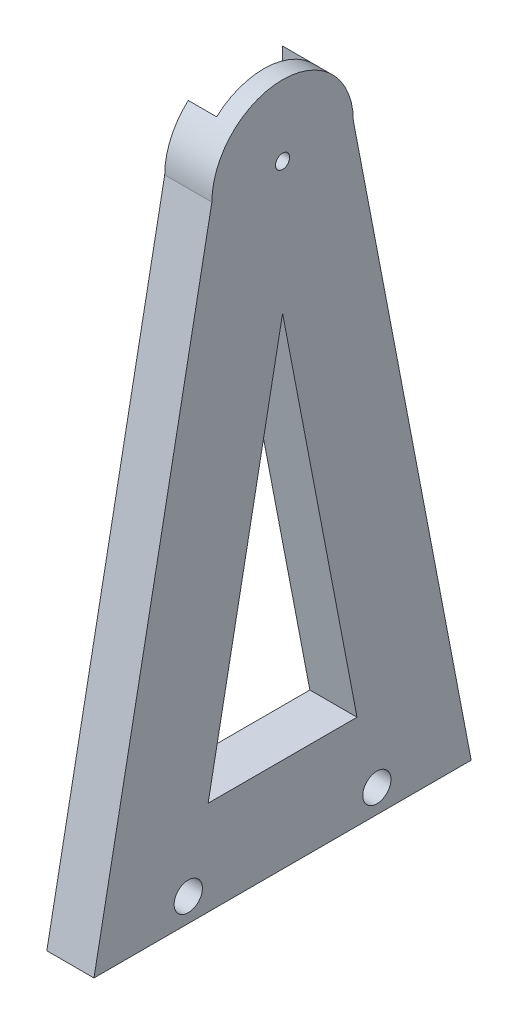
ISO-10303-21;
HEADER;
FILE_DESCRIPTION(('STEP AP214'),'2;1');
FILE_NAME('part.step','',(''),(''),'','','');
FILE_SCHEMA(('AUTOMOTIVE_DESIGN { 1 0 10303 214 1 1 1 1 }'));
ENDSEC;
DATA;
#1=APPLICATION_CONTEXT('core data for automotive mechanical design processes');
#2=APPLICATION_PROTOCOL_DEFINITION('international standard','automotive_design',2000,#1);
#3=PRODUCT_CONTEXT('',#1,'mechanical');
#4=PRODUCT('Part','Part','',(#3));
#5=PRODUCT_RELATED_PRODUCT_CATEGORY('part','',(#4));
#6=PRODUCT_DEFINITION_FORMATION('','',#4);
#7=PRODUCT_DEFINITION_CONTEXT('part definition',#1,'design');
#8=PRODUCT_DEFINITION('design','',#6,#7);
#9=PRODUCT_DEFINITION_SHAPE('','',#8);
#10=(LENGTH_UNIT() NAMED_UNIT(*) SI_UNIT(.MILLI.,.METRE.));
#11=(NAMED_UNIT(*) PLANE_ANGLE_UNIT() SI_UNIT($,.RADIAN.));
#12=(NAMED_UNIT(*) SI_UNIT($,.STERADIAN.) SOLID_ANGLE_UNIT());
#13=UNCERTAINTY_MEASURE_WITH_UNIT(LENGTH_MEASURE(1.E-05),#10,'distance_accuracy_value','');
#14=(GEOMETRIC_REPRESENTATION_CONTEXT(3) GLOBAL_UNCERTAINTY_ASSIGNED_CONTEXT((#13)) GLOBAL_UNIT_ASSIGNED_CONTEXT((#10,
#11,#12)) REPRESENTATION_CONTEXT('',''));
#15=CARTESIAN_POINT('',(0.,0.,0.));
#16=DIRECTION('',(0.,0.,1.));
#17=DIRECTION('',(1.,0.,0.));
#18=AXIS2_PLACEMENT_3D('',#15,#16,#17);
#19=CARTESIAN_POINT('',(10.,4.99999999999999,-20.));
#20=DIRECTION('',(-1.,0.,0.));
#21=DIRECTION('',(0.,0.,1.));
#22=AXIS2_PLACEMENT_3D('',#19,#20,#21);
#23=CYLINDRICAL_SURFACE('',#22,1.65);
#24=CARTESIAN_POINT('',(0.,4.99999999999999,-20.));
#25=DIRECTION('',(-1.,0.,0.));
#26=DIRECTION('',(0.,0.,-1.));
#27=AXIS2_PLACEMENT_3D('',#24,#25,#26);
#28=CIRCLE('',#27,1.65);
#29=CARTESIAN_POINT('',(0.,4.99999999999999,-21.65));
#30=VERTEX_POINT('',#29);
#31=EDGE_CURVE('E166',#30,#30,#28,.T.);
#32=ORIENTED_EDGE('',*,*,#31,.T.);
#33=EDGE_LOOP('',(#32));
#34=FACE_BOUND('',#33,.T.);
#35=CARTESIAN_POINT('',(5.,4.99999999999999,-20.));
#36=DIRECTION('',(1.,0.,0.));
#37=DIRECTION('',(0.,0.,-1.));
#38=AXIS2_PLACEMENT_3D('',#35,#36,#37);
#39=CIRCLE('',#38,1.65);
#40=CARTESIAN_POINT('',(5.,4.99999999999999,-21.65));
#41=VERTEX_POINT('',#40);
#42=EDGE_CURVE('E36',#41,#41,#39,.F.);
#43=ORIENTED_EDGE('',*,*,#42,.F.);
#44=EDGE_LOOP('',(#43));
#45=FACE_BOUND('',#44,.T.);
#46=ADVANCED_FACE('F32',(#34,#45),#23,.F.);
#47=CARTESIAN_POINT('',(10.,4.99999999999999,20.));
#48=DIRECTION('',(-1.,0.,0.));
#49=DIRECTION('',(0.,0.,1.));
#50=AXIS2_PLACEMENT_3D('',#47,#48,#49);
#51=CYLINDRICAL_SURFACE('',#50,1.65);
#52=CARTESIAN_POINT('',(0.,4.99999999999999,20.));
#53=DIRECTION('',(-1.,0.,0.));
#54=DIRECTION('',(0.,0.,1.));
#55=AXIS2_PLACEMENT_3D('',#52,#53,#54);
#56=CIRCLE('',#55,1.65);
#57=CARTESIAN_POINT('',(0.,4.99999999999999,21.65));
#58=VERTEX_POINT('',#57);
#59=EDGE_CURVE('E162',#58,#58,#56,.T.);
#60=ORIENTED_EDGE('',*,*,#59,.T.);
#61=EDGE_LOOP('',(#60));
#62=FACE_BOUND('',#61,.T.);
#63=CARTESIAN_POINT('',(5.,4.99999999999999,20.));
#64=DIRECTION('',(1.,0.,0.));
#65=DIRECTION('',(0.,0.,-1.));
#66=AXIS2_PLACEMENT_3D('',#63,#64,#65);
#67=CIRCLE('',#66,1.65);
#68=CARTESIAN_POINT('',(5.,4.99999999999999,18.35));
#69=VERTEX_POINT('',#68);
#70=EDGE_CURVE('E153',#69,#69,#67,.F.);
#71=ORIENTED_EDGE('',*,*,#70,.F.);
#72=EDGE_LOOP('',(#71));
#73=FACE_BOUND('',#72,.T.);
#74=ADVANCED_FACE('F234',(#62,#73),#51,.F.);
#75=CARTESIAN_POINT('',(10.,0.,-40.));
#76=DIRECTION('',(0.,-0.188847393650124,0.982006446980647));
#77=DIRECTION('',(0.,-0.982006446980647,-0.188847393650124));
#78=AXIS2_PLACEMENT_3D('',#75,#76,#77);
#79=PLANE('',#78);
#80=DIRECTION('',(0.,0.982006446980647,0.188847393650124));
#81=VECTOR('',#80,1.);
#82=CARTESIAN_POINT('',(0.,0.,-40.));
#83=LINE('',#82,#81);
#84=CARTESIAN_POINT('',(0.,0.,-40.));
#85=VERTEX_POINT('',#84);
#86=CARTESIAN_POINT('',(0.,130.,-15.));
#87=VERTEX_POINT('',#86);
#88=EDGE_CURVE('E192',#85,#87,#83,.T.);
#89=ORIENTED_EDGE('',*,*,#88,.T.);
#90=DIRECTION('',(-1.,0.,0.));
#91=VECTOR('',#90,1.);
#92=CARTESIAN_POINT('',(10.,130.,-15.));
#93=LINE('',#92,#91);
#94=CARTESIAN_POINT('',(10.,130.,-15.));
#95=VERTEX_POINT('',#94);
#96=EDGE_CURVE('E221',#95,#87,#93,.T.);
#97=ORIENTED_EDGE('',*,*,#96,.F.);
#98=DIRECTION('',(0.,0.982006446980647,0.188847393650124));
#99=VECTOR('',#98,1.);
#100=CARTESIAN_POINT('',(10.,0.,-40.));
#101=LINE('',#100,#99);
#102=CARTESIAN_POINT('',(10.,0.,-40.));
#103=VERTEX_POINT('',#102);
#104=EDGE_CURVE('E193',#103,#95,#101,.T.);
#105=ORIENTED_EDGE('',*,*,#104,.F.);
#106=DIRECTION('',(-1.,0.,0.));
#107=VECTOR('',#106,1.);
#108=CARTESIAN_POINT('',(10.,0.,-40.));
#109=LINE('',#108,#107);
#110=EDGE_CURVE('E203',#103,#85,#109,.T.);
#111=ORIENTED_EDGE('',*,*,#110,.T.);
#112=EDGE_LOOP('',(#89,#97,#105,#111));
#113=FACE_BOUND('',#112,.T.);
#114=ADVANCED_FACE('F34',(#113),#79,.F.);
#115=CARTESIAN_POINT('',(10.,130.,0.));
#116=DIRECTION('',(-1.,0.,0.));
#117=DIRECTION('',(0.,0.,1.));
#118=AXIS2_PLACEMENT_3D('',#115,#116,#117);
#119=CYLINDRICAL_SURFACE('',#118,15.);
#120=CARTESIAN_POINT('',(0.,130.,0.));
#121=DIRECTION('',(1.,0.,0.));
#122=DIRECTION('',(0.,0.,-1.));
#123=AXIS2_PLACEMENT_3D('',#120,#121,#122);
#124=CIRCLE('',#123,15.);
#125=CARTESIAN_POINT('',(0.,141.180339887499,-10.));
#126=VERTEX_POINT('',#125);
#127=EDGE_CURVE('E207',#87,#126,#124,.T.);
#128=ORIENTED_EDGE('',*,*,#127,.T.);
#129=DIRECTION('',(-1.,0.,0.));
#130=VECTOR('',#129,1.);
#131=CARTESIAN_POINT('',(10.,141.180339887499,-10.));
#132=LINE('',#131,#130);
#133=CARTESIAN_POINT('',(6.,141.180339887499,-10.));
#134=VERTEX_POINT('',#133);
#135=EDGE_CURVE('E189',#126,#134,#132,.F.);
#136=ORIENTED_EDGE('',*,*,#135,.T.);
#137=CARTESIAN_POINT('',(6.,130.,0.));
#138=DIRECTION('',(-1.,0.,0.));
#139=DIRECTION('',(0.,0.,1.));
#140=AXIS2_PLACEMENT_3D('',#137,#138,#139);
#141=CIRCLE('',#140,15.);
#142=CARTESIAN_POINT('',(6.,141.180339887499,10.));
#143=VERTEX_POINT('',#142);
#144=EDGE_CURVE('E11',#143,#134,#141,.T.);
#145=ORIENTED_EDGE('',*,*,#144,.F.);
#146=DIRECTION('',(-1.,0.,0.));
#147=VECTOR('',#146,1.);
#148=CARTESIAN_POINT('',(10.,141.180339887499,10.));
#149=LINE('',#148,#147);
#150=CARTESIAN_POINT('',(0.,141.180339887499,10.));
#151=VERTEX_POINT('',#150);
#152=EDGE_CURVE('E184',#143,#151,#149,.T.);
#153=ORIENTED_EDGE('',*,*,#152,.T.);
#154=CARTESIAN_POINT('',(0.,130.,15.));
#155=VERTEX_POINT('',#154);
#156=EDGE_CURVE('E206',#151,#155,#124,.T.);
#157=ORIENTED_EDGE('',*,*,#156,.T.);
#158=DIRECTION('',(-1.,0.,0.));
#159=VECTOR('',#158,1.);
#160=CARTESIAN_POINT('',(10.,130.,15.));
#161=LINE('',#160,#159);
#162=CARTESIAN_POINT('',(10.,130.,15.));
#163=VERTEX_POINT('',#162);
#164=EDGE_CURVE('E218',#163,#155,#161,.T.);
#165=ORIENTED_EDGE('',*,*,#164,.F.);
#166=CARTESIAN_POINT('',(10.,130.,0.));
#167=DIRECTION('',(1.,0.,0.));
#168=DIRECTION('',(0.,0.,-1.));
#169=AXIS2_PLACEMENT_3D('',#166,#167,#168);
#170=CIRCLE('',#169,15.);
#171=EDGE_CURVE('E196',#95,#163,#170,.T.);
#172=ORIENTED_EDGE('',*,*,#171,.F.);
#173=ORIENTED_EDGE('',*,*,#96,.T.);
#174=EDGE_LOOP('',(#128,#136,#145,#153,#157,#165,#172,#173));
#175=FACE_BOUND('',#174,.T.);
#176=ADVANCED_FACE('F273',(#175),#119,.T.);
#177=CARTESIAN_POINT('',(10.,0.,40.));
#178=DIRECTION('',(0.,-0.188847393650124,-0.982006446980647));
#179=DIRECTION('',(0.,0.982006446980647,-0.188847393650124));
#180=AXIS2_PLACEMENT_3D('',#177,#178,#179);
#181=PLANE('',#180);
#182=DIRECTION('',(0.,-0.982006446980647,0.188847393650124));
#183=VECTOR('',#182,1.);
#184=CARTESIAN_POINT('',(0.,0.,40.));
#185=LINE('',#184,#183);
#186=CARTESIAN_POINT('',(0.,0.,40.));
#187=VERTEX_POINT('',#186);
#188=EDGE_CURVE('E210',#155,#187,#185,.T.);
#189=ORIENTED_EDGE('',*,*,#188,.T.);
#190=DIRECTION('',(-1.,0.,0.));
#191=VECTOR('',#190,1.);
#192=CARTESIAN_POINT('',(10.,0.,40.));
#193=LINE('',#192,#191);
#194=CARTESIAN_POINT('',(10.,0.,40.));
#195=VERTEX_POINT('',#194);
#196=EDGE_CURVE('E215',#195,#187,#193,.T.);
#197=ORIENTED_EDGE('',*,*,#196,.F.);
#198=DIRECTION('',(0.,-0.982006446980647,0.188847393650124));
#199=VECTOR('',#198,1.);
#200=CARTESIAN_POINT('',(10.,0.,40.));
#201=LINE('',#200,#199);
#202=EDGE_CURVE('E199',#163,#195,#201,.T.);
#203=ORIENTED_EDGE('',*,*,#202,.F.);
#204=ORIENTED_EDGE('',*,*,#164,.T.);
#205=EDGE_LOOP('',(#189,#197,#203,#204));
#206=FACE_BOUND('',#205,.T.);
#207=ADVANCED_FACE('F270',(#206),#181,.F.);
#208=CARTESIAN_POINT('',(10.,0.,-40.));
#209=DIRECTION('',(0.,1.,0.));
#210=DIRECTION('',(0.,0.,1.));
#211=AXIS2_PLACEMENT_3D('',#208,#209,#210);
#212=PLANE('',#211);
#213=DIRECTION('',(0.,0.,-1.));
#214=VECTOR('',#213,1.);
#215=CARTESIAN_POINT('',(0.,0.,-40.));
#216=LINE('',#215,#214);
#217=EDGE_CURVE('E197',#187,#85,#216,.T.);
#218=ORIENTED_EDGE('',*,*,#217,.T.);
#219=ORIENTED_EDGE('',*,*,#110,.F.);
#220=DIRECTION('',(0.,0.,-1.));
#221=VECTOR('',#220,1.);
#222=CARTESIAN_POINT('',(10.,0.,-40.));
#223=LINE('',#222,#221);
#224=EDGE_CURVE('E201',#195,#103,#223,.T.);
#225=ORIENTED_EDGE('',*,*,#224,.F.);
#226=ORIENTED_EDGE('',*,*,#196,.T.);
#227=EDGE_LOOP('',(#218,#219,#225,#226));
#228=FACE_BOUND('',#227,.T.);
#229=ADVANCED_FACE('F264',(#228),#212,.F.);
#230=CARTESIAN_POINT('',(10.,130.,0.));
#231=DIRECTION('',(1.,0.,0.));
#232=DIRECTION('',(0.,0.,-1.));
#233=AXIS2_PLACEMENT_3D('',#230,#231,#232);
#234=PLANE('',#233);
#235=DIRECTION('',(0.,0.982006446980647,-0.188847393650125));
#236=VECTOR('',#235,1.);
#237=CARTESIAN_POINT('',(10.,20.,15.7873810848096));
#238=LINE('',#237,#236);
#239=CARTESIAN_POINT('',(10.,20.,15.7873810848096));
#240=VERTEX_POINT('',#239);
#241=CARTESIAN_POINT('',(10.,102.09438164101,0.));
#242=VERTEX_POINT('',#241);
#243=EDGE_CURVE('E118',#240,#242,#238,.T.);
#244=ORIENTED_EDGE('',*,*,#243,.T.);
#245=DIRECTION('',(0.,-0.982006446980647,-0.188847393650125));
#246=VECTOR('',#245,1.);
#247=CARTESIAN_POINT('',(10.,102.09438164101,0.));
#248=LINE('',#247,#246);
#249=CARTESIAN_POINT('',(10.,20.,-15.7873810848097));
#250=VERTEX_POINT('',#249);
#251=EDGE_CURVE('E125',#242,#250,#248,.T.);
#252=ORIENTED_EDGE('',*,*,#251,.T.);
#253=DIRECTION('',(0.,0.,1.));
#254=VECTOR('',#253,1.);
#255=CARTESIAN_POINT('',(10.,20.,-15.7873810848097));
#256=LINE('',#255,#254);
#257=EDGE_CURVE('E49',#250,#240,#256,.T.);
#258=ORIENTED_EDGE('',*,*,#257,.T.);
#259=EDGE_LOOP('',(#244,#252,#258));
#260=FACE_BOUND('',#259,.T.);
#261=CARTESIAN_POINT('',(10.,130.,0.));
#262=DIRECTION('',(-1.,0.,0.));
#263=DIRECTION('',(0.,0.,1.));
#264=AXIS2_PLACEMENT_3D('',#261,#262,#263);
#265=CIRCLE('',#264,1.5);
#266=CARTESIAN_POINT('',(10.,130.,1.5));
#267=VERTEX_POINT('',#266);
#268=EDGE_CURVE('E144',#267,#267,#265,.T.);
#269=ORIENTED_EDGE('',*,*,#268,.T.);
#270=EDGE_LOOP('',(#269));
#271=FACE_BOUND('',#270,.T.);
#272=CARTESIAN_POINT('',(10.,4.99999999999999,20.));
#273=DIRECTION('',(1.,0.,0.));
#274=DIRECTION('',(0.,0.,-1.));
#275=AXIS2_PLACEMENT_3D('',#272,#273,#274);
#276=CIRCLE('',#275,3.);
#277=CARTESIAN_POINT('',(10.,4.99999999999999,17.));
#278=VERTEX_POINT('',#277);
#279=EDGE_CURVE('E154',#278,#278,#276,.T.);
#280=ORIENTED_EDGE('',*,*,#279,.F.);
#281=EDGE_LOOP('',(#280));
#282=FACE_BOUND('',#281,.T.);
#283=CARTESIAN_POINT('',(10.,4.99999999999999,-20.));
#284=DIRECTION('',(1.,0.,0.));
#285=DIRECTION('',(0.,0.,-1.));
#286=AXIS2_PLACEMENT_3D('',#283,#284,#285);
#287=CIRCLE('',#286,3.);
#288=CARTESIAN_POINT('',(10.,4.99999999999999,-23.));
#289=VERTEX_POINT('',#288);
#290=EDGE_CURVE('E147',#289,#289,#287,.T.);
#291=ORIENTED_EDGE('',*,*,#290,.F.);
#292=EDGE_LOOP('',(#291));
#293=FACE_BOUND('',#292,.T.);
#294=ORIENTED_EDGE('',*,*,#104,.T.);
#295=ORIENTED_EDGE('',*,*,#171,.T.);
#296=ORIENTED_EDGE('',*,*,#202,.T.);
#297=ORIENTED_EDGE('',*,*,#224,.T.);
#298=EDGE_LOOP('',(#294,#295,#296,#297));
#299=FACE_BOUND('',#298,.T.);
#300=ADVANCED_FACE('F129',(#260,#271,#282,#293,#299),#234,.T.);
#301=CARTESIAN_POINT('',(0.,130.,0.));
#302=DIRECTION('',(1.,0.,0.));
#303=DIRECTION('',(0.,0.,-1.));
#304=AXIS2_PLACEMENT_3D('',#301,#302,#303);
#305=PLANE('',#304);
#306=DIRECTION('',(0.,-0.982006446980647,-0.188847393650125));
#307=VECTOR('',#306,1.);
#308=CARTESIAN_POINT('',(0.,102.09438164101,0.));
#309=LINE('',#308,#307);
#310=CARTESIAN_POINT('',(0.,102.09438164101,0.));
#311=VERTEX_POINT('',#310);
#312=CARTESIAN_POINT('',(0.,20.,-15.7873810848097));
#313=VERTEX_POINT('',#312);
#314=EDGE_CURVE('E134',#311,#313,#309,.T.);
#315=ORIENTED_EDGE('',*,*,#314,.F.);
#316=DIRECTION('',(0.,0.982006446980647,-0.188847393650125));
#317=VECTOR('',#316,1.);
#318=CARTESIAN_POINT('',(0.,20.,15.7873810848096));
#319=LINE('',#318,#317);
#320=CARTESIAN_POINT('',(0.,20.,15.7873810848096));
#321=VERTEX_POINT('',#320);
#322=EDGE_CURVE('E57',#321,#311,#319,.T.);
#323=ORIENTED_EDGE('',*,*,#322,.F.);
#324=DIRECTION('',(0.,0.,1.));
#325=VECTOR('',#324,1.);
#326=CARTESIAN_POINT('',(0.,20.,-15.7873810848097));
#327=LINE('',#326,#325);
#328=EDGE_CURVE('E131',#313,#321,#327,.T.);
#329=ORIENTED_EDGE('',*,*,#328,.F.);
#330=EDGE_LOOP('',(#315,#323,#329));
#331=FACE_BOUND('',#330,.T.);
#332=ORIENTED_EDGE('',*,*,#59,.F.);
#333=EDGE_LOOP('',(#332));
#334=FACE_BOUND('',#333,.T.);
#335=ORIENTED_EDGE('',*,*,#31,.F.);
#336=EDGE_LOOP('',(#335));
#337=FACE_BOUND('',#336,.T.);
#338=CARTESIAN_POINT('',(0.,130.,0.));
#339=DIRECTION('',(-1.,0.,0.));
#340=DIRECTION('',(0.,0.,1.));
#341=AXIS2_PLACEMENT_3D('',#338,#339,#340);
#342=CIRCLE('',#341,10.);
#343=CARTESIAN_POINT('',(0.,130.,-10.));
#344=VERTEX_POINT('',#343);
#345=CARTESIAN_POINT('',(0.,130.,10.));
#346=VERTEX_POINT('',#345);
#347=EDGE_CURVE('E165',#344,#346,#342,.T.);
#348=ORIENTED_EDGE('',*,*,#347,.F.);
#349=DIRECTION('',(0.,1.,0.));
#350=VECTOR('',#349,1.);
#351=CARTESIAN_POINT('',(0.,130.,-10.));
#352=LINE('',#351,#350);
#353=EDGE_CURVE('E41',#344,#126,#352,.T.);
#354=ORIENTED_EDGE('',*,*,#353,.T.);
#355=ORIENTED_EDGE('',*,*,#127,.F.);
#356=ORIENTED_EDGE('',*,*,#88,.F.);
#357=ORIENTED_EDGE('',*,*,#217,.F.);
#358=ORIENTED_EDGE('',*,*,#188,.F.);
#359=ORIENTED_EDGE('',*,*,#156,.F.);
#360=DIRECTION('',(0.,1.,0.));
#361=VECTOR('',#360,1.);
#362=CARTESIAN_POINT('',(0.,151.126505972347,10.));
#363=LINE('',#362,#361);
#364=EDGE_CURVE('E173',#346,#151,#363,.T.);
#365=ORIENTED_EDGE('',*,*,#364,.F.);
#366=EDGE_LOOP('',(#348,#354,#355,#356,#357,#358,#359,#365));
#367=FACE_BOUND('',#366,.T.);
#368=ADVANCED_FACE('F248',(#331,#334,#337,#367),#305,.F.);
#369=CARTESIAN_POINT('',(6.,130.,0.));
#370=DIRECTION('',(-1.,0.,0.));
#371=DIRECTION('',(0.,0.,1.));
#372=AXIS2_PLACEMENT_3D('',#369,#370,#371);
#373=PLANE('',#372);
#374=CARTESIAN_POINT('',(6.,130.,0.));
#375=DIRECTION('',(-1.,0.,0.));
#376=DIRECTION('',(0.,0.,1.));
#377=AXIS2_PLACEMENT_3D('',#374,#375,#376);
#378=CIRCLE('',#377,1.5);
#379=CARTESIAN_POINT('',(6.,130.,1.5));
#380=VERTEX_POINT('',#379);
#381=EDGE_CURVE('E142',#380,#380,#378,.T.);
#382=ORIENTED_EDGE('',*,*,#381,.F.);
#383=EDGE_LOOP('',(#382));
#384=FACE_BOUND('',#383,.T.);
#385=ORIENTED_EDGE('',*,*,#144,.T.);
#386=DIRECTION('',(0.,-1.,0.));
#387=VECTOR('',#386,1.);
#388=CARTESIAN_POINT('',(6.,130.,-10.));
#389=LINE('',#388,#387);
#390=CARTESIAN_POINT('',(6.,130.,-10.));
#391=VERTEX_POINT('',#390);
#392=EDGE_CURVE('E176',#134,#391,#389,.T.);
#393=ORIENTED_EDGE('',*,*,#392,.T.);
#394=CARTESIAN_POINT('',(6.,130.,0.));
#395=DIRECTION('',(-1.,0.,0.));
#396=DIRECTION('',(0.,0.,1.));
#397=AXIS2_PLACEMENT_3D('',#394,#395,#396);
#398=CIRCLE('',#397,10.);
#399=CARTESIAN_POINT('',(6.,130.,10.));
#400=VERTEX_POINT('',#399);
#401=EDGE_CURVE('E169',#391,#400,#398,.T.);
#402=ORIENTED_EDGE('',*,*,#401,.T.);
#403=DIRECTION('',(0.,1.,0.));
#404=VECTOR('',#403,1.);
#405=CARTESIAN_POINT('',(6.,151.126505972347,10.));
#406=LINE('',#405,#404);
#407=EDGE_CURVE('E172',#400,#143,#406,.T.);
#408=ORIENTED_EDGE('',*,*,#407,.T.);
#409=EDGE_LOOP('',(#385,#393,#402,#408));
#410=FACE_BOUND('',#409,.T.);
#411=ADVANCED_FACE('F244',(#384,#410),#373,.T.);
#412=CARTESIAN_POINT('',(6.,130.,-10.));
#413=DIRECTION('',(0.,0.,-1.));
#414=DIRECTION('',(-1.,0.,0.));
#415=AXIS2_PLACEMENT_3D('',#412,#413,#414);
#416=PLANE('',#415);
#417=ORIENTED_EDGE('',*,*,#353,.F.);
#418=DIRECTION('',(-1.,0.,0.));
#419=VECTOR('',#418,1.);
#420=CARTESIAN_POINT('',(6.,130.,-10.));
#421=LINE('',#420,#419);
#422=EDGE_CURVE('E181',#391,#344,#421,.T.);
#423=ORIENTED_EDGE('',*,*,#422,.F.);
#424=ORIENTED_EDGE('',*,*,#392,.F.);
#425=ORIENTED_EDGE('',*,*,#135,.F.);
#426=EDGE_LOOP('',(#417,#423,#424,#425));
#427=FACE_BOUND('',#426,.T.);
#428=ADVANCED_FACE('F247',(#427),#416,.F.);
#429=CARTESIAN_POINT('',(6.,151.126505972347,10.));
#430=DIRECTION('',(0.,0.,1.));
#431=DIRECTION('',(1.,0.,0.));
#432=AXIS2_PLACEMENT_3D('',#429,#430,#431);
#433=PLANE('',#432);
#434=ORIENTED_EDGE('',*,*,#407,.F.);
#435=DIRECTION('',(-1.,0.,0.));
#436=VECTOR('',#435,1.);
#437=CARTESIAN_POINT('',(6.,130.,10.));
#438=LINE('',#437,#436);
#439=EDGE_CURVE('E178',#400,#346,#438,.T.);
#440=ORIENTED_EDGE('',*,*,#439,.T.);
#441=ORIENTED_EDGE('',*,*,#364,.T.);
#442=ORIENTED_EDGE('',*,*,#152,.F.);
#443=EDGE_LOOP('',(#434,#440,#441,#442));
#444=FACE_BOUND('',#443,.T.);
#445=ADVANCED_FACE('F252',(#444),#433,.F.);
#446=CARTESIAN_POINT('',(6.,130.,0.));
#447=DIRECTION('',(-1.,0.,0.));
#448=DIRECTION('',(0.,0.,1.));
#449=AXIS2_PLACEMENT_3D('',#446,#447,#448);
#450=CYLINDRICAL_SURFACE('',#449,10.);
#451=ORIENTED_EDGE('',*,*,#347,.T.);
#452=ORIENTED_EDGE('',*,*,#439,.F.);
#453=ORIENTED_EDGE('',*,*,#401,.F.);
#454=ORIENTED_EDGE('',*,*,#422,.T.);
#455=EDGE_LOOP('',(#451,#452,#453,#454));
#456=FACE_BOUND('',#455,.T.);
#457=ADVANCED_FACE('F256',(#456),#450,.F.);
#458=CARTESIAN_POINT('',(5.,4.99999999999999,20.));
#459=DIRECTION('',(1.,0.,0.));
#460=DIRECTION('',(0.,0.,-1.));
#461=AXIS2_PLACEMENT_3D('',#458,#459,#460);
#462=PLANE('',#461);
#463=CARTESIAN_POINT('',(5.,4.99999999999999,20.));
#464=DIRECTION('',(1.,0.,0.));
#465=DIRECTION('',(0.,0.,-1.));
#466=AXIS2_PLACEMENT_3D('',#463,#464,#465);
#467=CIRCLE('',#466,3.);
#468=CARTESIAN_POINT('',(5.,4.99999999999999,17.));
#469=VERTEX_POINT('',#468);
#470=EDGE_CURVE('E150',#469,#469,#467,.T.);
#471=ORIENTED_EDGE('',*,*,#470,.T.);
#472=EDGE_LOOP('',(#471));
#473=FACE_BOUND('',#472,.T.);
#474=ORIENTED_EDGE('',*,*,#70,.T.);
#475=EDGE_LOOP('',(#474));
#476=FACE_BOUND('',#475,.T.);
#477=ADVANCED_FACE('F260',(#473,#476),#462,.T.);
#478=CARTESIAN_POINT('',(5.,4.99999999999999,20.));
#479=DIRECTION('',(1.,0.,0.));
#480=DIRECTION('',(0.,0.,-1.));
#481=AXIS2_PLACEMENT_3D('',#478,#479,#480);
#482=CYLINDRICAL_SURFACE('',#481,3.);
#483=ORIENTED_EDGE('',*,*,#470,.F.);
#484=EDGE_LOOP('',(#483));
#485=FACE_BOUND('',#484,.T.);
#486=ORIENTED_EDGE('',*,*,#279,.T.);
#487=EDGE_LOOP('',(#486));
#488=FACE_BOUND('',#487,.T.);
#489=ADVANCED_FACE('F322',(#485,#488),#482,.F.);
#490=CARTESIAN_POINT('',(5.,4.99999999999999,-20.));
#491=DIRECTION('',(1.,0.,0.));
#492=DIRECTION('',(0.,0.,-1.));
#493=AXIS2_PLACEMENT_3D('',#490,#491,#492);
#494=PLANE('',#493);
#495=CARTESIAN_POINT('',(5.,4.99999999999999,-20.));
#496=DIRECTION('',(1.,0.,0.));
#497=DIRECTION('',(0.,0.,-1.));
#498=AXIS2_PLACEMENT_3D('',#495,#496,#497);
#499=CIRCLE('',#498,3.);
#500=CARTESIAN_POINT('',(5.,4.99999999999999,-23.));
#501=VERTEX_POINT('',#500);
#502=EDGE_CURVE('E157',#501,#501,#499,.T.);
#503=ORIENTED_EDGE('',*,*,#502,.T.);
#504=EDGE_LOOP('',(#503));
#505=FACE_BOUND('',#504,.T.);
#506=ORIENTED_EDGE('',*,*,#42,.T.);
#507=EDGE_LOOP('',(#506));
#508=FACE_BOUND('',#507,.T.);
#509=ADVANCED_FACE('F231',(#505,#508),#494,.T.);
#510=CARTESIAN_POINT('',(5.,4.99999999999999,-20.));
#511=DIRECTION('',(1.,0.,0.));
#512=DIRECTION('',(0.,0.,-1.));
#513=AXIS2_PLACEMENT_3D('',#510,#511,#512);
#514=CYLINDRICAL_SURFACE('',#513,3.);
#515=ORIENTED_EDGE('',*,*,#502,.F.);
#516=EDGE_LOOP('',(#515));
#517=FACE_BOUND('',#516,.T.);
#518=ORIENTED_EDGE('',*,*,#290,.T.);
#519=EDGE_LOOP('',(#518));
#520=FACE_BOUND('',#519,.T.);
#521=ADVANCED_FACE('F341',(#517,#520),#514,.F.);
#522=CARTESIAN_POINT('',(10.,130.,0.));
#523=DIRECTION('',(-1.,0.,0.));
#524=DIRECTION('',(0.,0.,1.));
#525=AXIS2_PLACEMENT_3D('',#522,#523,#524);
#526=CYLINDRICAL_SURFACE('',#525,1.5);
#527=ORIENTED_EDGE('',*,*,#268,.F.);
#528=EDGE_LOOP('',(#527));
#529=FACE_BOUND('',#528,.T.);
#530=ORIENTED_EDGE('',*,*,#381,.T.);
#531=EDGE_LOOP('',(#530));
#532=FACE_BOUND('',#531,.T.);
#533=ADVANCED_FACE('F351',(#529,#532),#526,.F.);
#534=CARTESIAN_POINT('',(10.,20.,15.7873810848096));
#535=DIRECTION('',(0.,0.188847393650125,0.982006446980647));
#536=DIRECTION('',(0.,-0.982006446980647,0.188847393650125));
#537=AXIS2_PLACEMENT_3D('',#534,#535,#536);
#538=PLANE('',#537);
#539=ORIENTED_EDGE('',*,*,#322,.T.);
#540=DIRECTION('',(-1.,0.,0.));
#541=VECTOR('',#540,1.);
#542=CARTESIAN_POINT('',(10.,102.09438164101,0.));
#543=LINE('',#542,#541);
#544=EDGE_CURVE('E114',#242,#311,#543,.T.);
#545=ORIENTED_EDGE('',*,*,#544,.F.);
#546=ORIENTED_EDGE('',*,*,#243,.F.);
#547=DIRECTION('',(-1.,0.,0.));
#548=VECTOR('',#547,1.);
#549=CARTESIAN_POINT('',(10.,20.,15.7873810848096));
#550=LINE('',#549,#548);
#551=EDGE_CURVE('E140',#240,#321,#550,.T.);
#552=ORIENTED_EDGE('',*,*,#551,.T.);
#553=EDGE_LOOP('',(#539,#545,#546,#552));
#554=FACE_BOUND('',#553,.T.);
#555=ADVANCED_FACE('F116',(#554),#538,.F.);
#556=CARTESIAN_POINT('',(10.,20.,-15.7873810848097));
#557=DIRECTION('',(0.,-1.,0.));
#558=DIRECTION('',(0.,0.,-1.));
#559=AXIS2_PLACEMENT_3D('',#556,#557,#558);
#560=PLANE('',#559);
#561=ORIENTED_EDGE('',*,*,#328,.T.);
#562=ORIENTED_EDGE('',*,*,#551,.F.);
#563=ORIENTED_EDGE('',*,*,#257,.F.);
#564=DIRECTION('',(-1.,0.,0.));
#565=VECTOR('',#564,1.);
#566=CARTESIAN_POINT('',(10.,20.,-15.7873810848097));
#567=LINE('',#566,#565);
#568=EDGE_CURVE('E122',#250,#313,#567,.T.);
#569=ORIENTED_EDGE('',*,*,#568,.T.);
#570=EDGE_LOOP('',(#561,#562,#563,#569));
#571=FACE_BOUND('',#570,.T.);
#572=ADVANCED_FACE('F389',(#571),#560,.F.);
#573=CARTESIAN_POINT('',(10.,102.09438164101,0.));
#574=DIRECTION('',(0.,0.188847393650125,-0.982006446980647));
#575=DIRECTION('',(0.,0.982006446980647,0.188847393650125));
#576=AXIS2_PLACEMENT_3D('',#573,#574,#575);
#577=PLANE('',#576);
#578=ORIENTED_EDGE('',*,*,#314,.T.);
#579=ORIENTED_EDGE('',*,*,#568,.F.);
#580=ORIENTED_EDGE('',*,*,#251,.F.);
#581=ORIENTED_EDGE('',*,*,#544,.T.);
#582=EDGE_LOOP('',(#578,#579,#580,#581));
#583=FACE_BOUND('',#582,.T.);
#584=ADVANCED_FACE('F126',(#583),#577,.F.);
#585=CLOSED_SHELL('',(#46,#74,#114,#176,#207,#229,#300,#368,#411,#428,#445,#457,#477,#489,#509,
#521,#533,#555,#572,#584));
#586=MANIFOLD_SOLID_BREP('B2',#585);
#587=ADVANCED_BREP_SHAPE_REPRESENTATION('',(#18,#586),#14);
#588=SHAPE_DEFINITION_REPRESENTATION(#9,#587);
ENDSEC;
END-ISO-10303-21;
